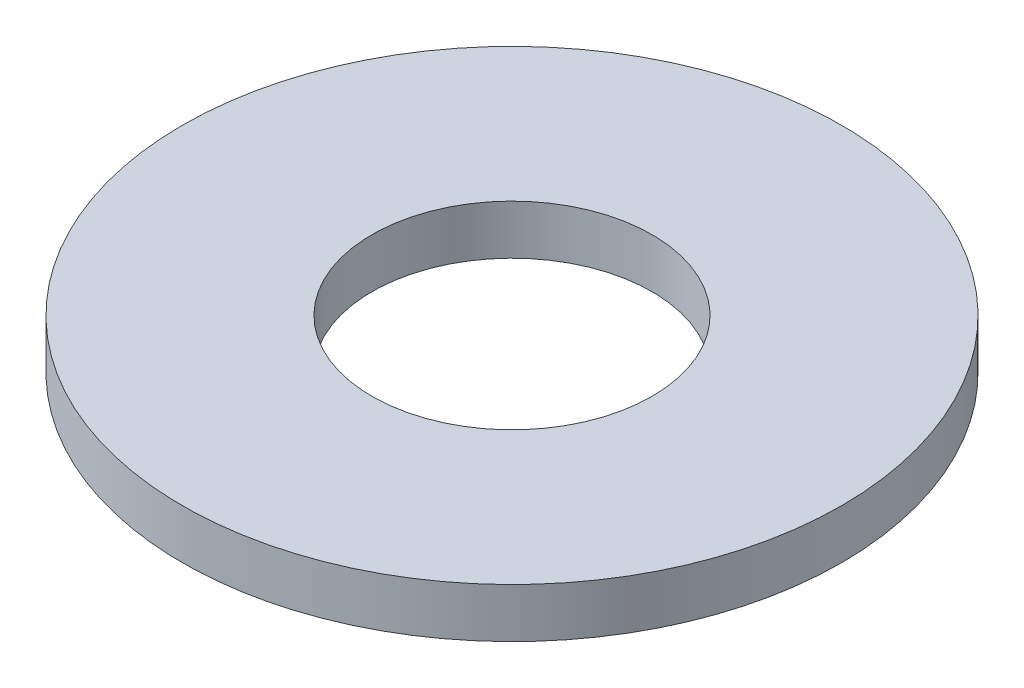
ISO-10303-21;
HEADER;
FILE_DESCRIPTION(('STEP AP214'),'2;1');
FILE_NAME('part.step','',(''),(''),'','','');
FILE_SCHEMA(('AUTOMOTIVE_DESIGN { 1 0 10303 214 1 1 1 1 }'));
ENDSEC;
DATA;
#1=APPLICATION_CONTEXT('core data for automotive mechanical design processes');
#2=APPLICATION_PROTOCOL_DEFINITION('international standard','automotive_design',2000,#1);
#3=PRODUCT_CONTEXT('',#1,'mechanical');
#4=PRODUCT('Part','Part','',(#3));
#5=PRODUCT_RELATED_PRODUCT_CATEGORY('part','',(#4));
#6=PRODUCT_DEFINITION_FORMATION('','',#4);
#7=PRODUCT_DEFINITION_CONTEXT('part definition',#1,'design');
#8=PRODUCT_DEFINITION('design','',#6,#7);
#9=PRODUCT_DEFINITION_SHAPE('','',#8);
#10=(LENGTH_UNIT() NAMED_UNIT(*) SI_UNIT(.MILLI.,.METRE.));
#11=(NAMED_UNIT(*) PLANE_ANGLE_UNIT() SI_UNIT($,.RADIAN.));
#12=(NAMED_UNIT(*) SI_UNIT($,.STERADIAN.) SOLID_ANGLE_UNIT());
#13=UNCERTAINTY_MEASURE_WITH_UNIT(LENGTH_MEASURE(1.E-05),#10,'distance_accuracy_value','');
#14=(GEOMETRIC_REPRESENTATION_CONTEXT(3) GLOBAL_UNCERTAINTY_ASSIGNED_CONTEXT((#13)) GLOBAL_UNIT_ASSIGNED_CONTEXT((#10,
#11,#12)) REPRESENTATION_CONTEXT('',''));
#15=CARTESIAN_POINT('',(0.,0.,0.));
#16=DIRECTION('',(0.,0.,1.));
#17=DIRECTION('',(1.,0.,0.));
#18=AXIS2_PLACEMENT_3D('',#15,#16,#17);
#19=CARTESIAN_POINT('',(0.,0.,0.));
#20=DIRECTION('',(0.,1.,0.));
#21=DIRECTION('',(0.,0.,1.));
#22=AXIS2_PLACEMENT_3D('',#19,#20,#21);
#23=PLANE('',#22);
#24=CARTESIAN_POINT('',(0.,0.,0.));
#25=DIRECTION('',(0.,-1.,0.));
#26=DIRECTION('',(1.,0.,0.));
#27=AXIS2_PLACEMENT_3D('',#24,#25,#26);
#28=CIRCLE('',#27,17.);
#29=CARTESIAN_POINT('',(17.,0.,0.));
#30=VERTEX_POINT('',#29);
#31=EDGE_CURVE('E26',#30,#30,#28,.F.);
#32=ORIENTED_EDGE('',*,*,#31,.T.);
#33=EDGE_LOOP('',(#32));
#34=FACE_BOUND('',#33,.T.);
#35=CARTESIAN_POINT('',(0.,0.,0.));
#36=DIRECTION('',(0.,-1.,0.));
#37=DIRECTION('',(1.,0.,0.));
#38=AXIS2_PLACEMENT_3D('',#35,#36,#37);
#39=CIRCLE('',#38,40.0000000000001);
#40=CARTESIAN_POINT('',(40.0000000000001,0.,0.));
#41=VERTEX_POINT('',#40);
#42=EDGE_CURVE('E17',#41,#41,#39,.F.);
#43=ORIENTED_EDGE('',*,*,#42,.F.);
#44=EDGE_LOOP('',(#43));
#45=FACE_BOUND('',#44,.T.);
#46=ADVANCED_FACE('F14',(#34,#45),#23,.F.);
#47=CARTESIAN_POINT('',(0.,6.00000000000001,0.));
#48=DIRECTION('',(0.,-1.,0.));
#49=DIRECTION('',(1.,0.,0.));
#50=AXIS2_PLACEMENT_3D('',#47,#48,#49);
#51=CYLINDRICAL_SURFACE('',#50,40.0000000000001);
#52=ORIENTED_EDGE('',*,*,#42,.T.);
#53=EDGE_LOOP('',(#52));
#54=FACE_BOUND('',#53,.T.);
#55=CARTESIAN_POINT('',(0.,6.00000000000001,0.));
#56=DIRECTION('',(0.,-1.,0.));
#57=DIRECTION('',(1.,0.,0.));
#58=AXIS2_PLACEMENT_3D('',#55,#56,#57);
#59=CIRCLE('',#58,40.0000000000001);
#60=CARTESIAN_POINT('',(40.0000000000001,6.00000000000001,0.));
#61=VERTEX_POINT('',#60);
#62=EDGE_CURVE('E21',#61,#61,#59,.F.);
#63=ORIENTED_EDGE('',*,*,#62,.F.);
#64=EDGE_LOOP('',(#63));
#65=FACE_BOUND('',#64,.T.);
#66=ADVANCED_FACE('F34',(#54,#65),#51,.T.);
#67=CARTESIAN_POINT('',(0.,6.00000000000001,0.));
#68=DIRECTION('',(0.,-1.,0.));
#69=DIRECTION('',(1.,0.,0.));
#70=AXIS2_PLACEMENT_3D('',#67,#68,#69);
#71=CYLINDRICAL_SURFACE('',#70,17.);
#72=CARTESIAN_POINT('',(0.,6.00000000000001,0.));
#73=DIRECTION('',(0.,-1.,0.));
#74=DIRECTION('',(1.,0.,0.));
#75=AXIS2_PLACEMENT_3D('',#72,#73,#74);
#76=CIRCLE('',#75,17.);
#77=CARTESIAN_POINT('',(17.,6.00000000000001,0.));
#78=VERTEX_POINT('',#77);
#79=EDGE_CURVE('E10',#78,#78,#76,.T.);
#80=ORIENTED_EDGE('',*,*,#79,.F.);
#81=EDGE_LOOP('',(#80));
#82=FACE_BOUND('',#81,.T.);
#83=ORIENTED_EDGE('',*,*,#31,.F.);
#84=EDGE_LOOP('',(#83));
#85=FACE_BOUND('',#84,.T.);
#86=ADVANCED_FACE('F42',(#82,#85),#71,.F.);
#87=CARTESIAN_POINT('',(0.,6.00000000000001,0.));
#88=DIRECTION('',(0.,1.,0.));
#89=DIRECTION('',(0.,0.,1.));
#90=AXIS2_PLACEMENT_3D('',#87,#88,#89);
#91=PLANE('',#90);
#92=ORIENTED_EDGE('',*,*,#79,.T.);
#93=EDGE_LOOP('',(#92));
#94=FACE_BOUND('',#93,.T.);
#95=ORIENTED_EDGE('',*,*,#62,.T.);
#96=EDGE_LOOP('',(#95));
#97=FACE_BOUND('',#96,.T.);
#98=ADVANCED_FACE('F43',(#94,#97),#91,.T.);
#99=CLOSED_SHELL('',(#46,#66,#86,#98));
#100=MANIFOLD_SOLID_BREP('B1',#99);
#101=ADVANCED_BREP_SHAPE_REPRESENTATION('',(#18,#100),#14);
#102=SHAPE_DEFINITION_REPRESENTATION(#9,#101);
ENDSEC;
END-ISO-10303-21;
